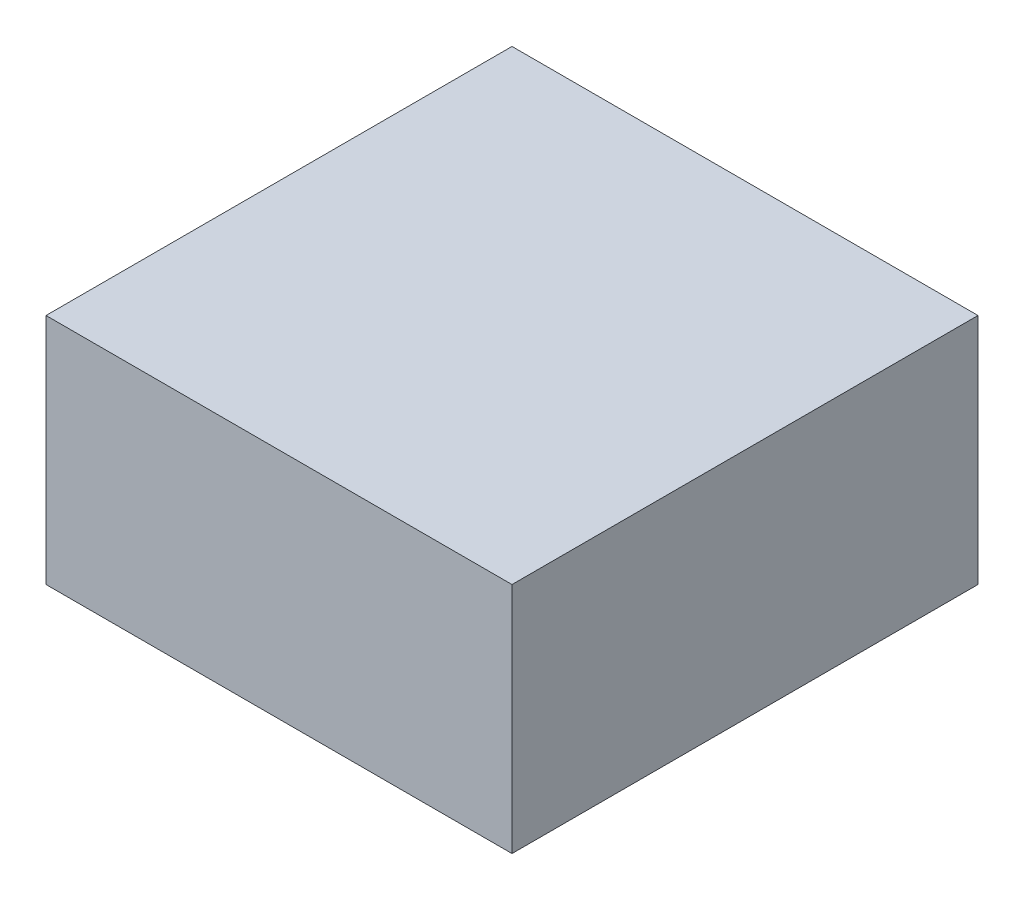
ISO-10303-21;
HEADER;
FILE_DESCRIPTION(('STEP AP214'),'2;1');
FILE_NAME('part.step','',(''),(''),'','','');
FILE_SCHEMA(('AUTOMOTIVE_DESIGN { 1 0 10303 214 1 1 1 1 }'));
ENDSEC;
DATA;
#1=APPLICATION_CONTEXT('core data for automotive mechanical design processes');
#2=APPLICATION_PROTOCOL_DEFINITION('international standard','automotive_design',2000,#1);
#3=PRODUCT_CONTEXT('',#1,'mechanical');
#4=PRODUCT('Part','Part','',(#3));
#5=PRODUCT_RELATED_PRODUCT_CATEGORY('part','',(#4));
#6=PRODUCT_DEFINITION_FORMATION('','',#4);
#7=PRODUCT_DEFINITION_CONTEXT('part definition',#1,'design');
#8=PRODUCT_DEFINITION('design','',#6,#7);
#9=PRODUCT_DEFINITION_SHAPE('','',#8);
#10=(LENGTH_UNIT() NAMED_UNIT(*) SI_UNIT(.MILLI.,.METRE.));
#11=(NAMED_UNIT(*) PLANE_ANGLE_UNIT() SI_UNIT($,.RADIAN.));
#12=(NAMED_UNIT(*) SI_UNIT($,.STERADIAN.) SOLID_ANGLE_UNIT());
#13=UNCERTAINTY_MEASURE_WITH_UNIT(LENGTH_MEASURE(1.E-05),#10,'distance_accuracy_value','');
#14=(GEOMETRIC_REPRESENTATION_CONTEXT(3) GLOBAL_UNCERTAINTY_ASSIGNED_CONTEXT((#13)) GLOBAL_UNIT_ASSIGNED_CONTEXT((#10,
#11,#12)) REPRESENTATION_CONTEXT('',''));
#15=CARTESIAN_POINT('',(0.,0.,0.));
#16=DIRECTION('',(0.,0.,1.));
#17=DIRECTION('',(1.,0.,0.));
#18=AXIS2_PLACEMENT_3D('',#15,#16,#17);
#19=CARTESIAN_POINT('',(-50.,-25.,100.));
#20=DIRECTION('',(1.,0.,0.));
#21=DIRECTION('',(0.,0.,-1.));
#22=AXIS2_PLACEMENT_3D('',#19,#20,#21);
#23=PLANE('',#22);
#24=DIRECTION('',(0.,-1.,0.));
#25=VECTOR('',#24,1.);
#26=CARTESIAN_POINT('',(-50.,-25.,0.));
#27=LINE('',#26,#25);
#28=CARTESIAN_POINT('',(-50.,25.,0.));
#29=VERTEX_POINT('',#28);
#30=CARTESIAN_POINT('',(-50.,-25.,0.));
#31=VERTEX_POINT('',#30);
#32=EDGE_CURVE('E113',#29,#31,#27,.T.);
#33=ORIENTED_EDGE('',*,*,#32,.T.);
#34=DIRECTION('',(0.,0.,-1.));
#35=VECTOR('',#34,1.);
#36=CARTESIAN_POINT('',(-50.,-25.,100.));
#37=LINE('',#36,#35);
#38=CARTESIAN_POINT('',(-50.,-25.,100.));
#39=VERTEX_POINT('',#38);
#40=EDGE_CURVE('E11',#39,#31,#37,.T.);
#41=ORIENTED_EDGE('',*,*,#40,.F.);
#42=DIRECTION('',(0.,-1.,0.));
#43=VECTOR('',#42,1.);
#44=CARTESIAN_POINT('',(-50.,-25.,100.));
#45=LINE('',#44,#43);
#46=CARTESIAN_POINT('',(-50.,25.,100.));
#47=VERTEX_POINT('',#46);
#48=EDGE_CURVE('E97',#47,#39,#45,.T.);
#49=ORIENTED_EDGE('',*,*,#48,.F.);
#50=DIRECTION('',(0.,0.,-1.));
#51=VECTOR('',#50,1.);
#52=CARTESIAN_POINT('',(-50.,25.,100.));
#53=LINE('',#52,#51);
#54=EDGE_CURVE('E109',#47,#29,#53,.T.);
#55=ORIENTED_EDGE('',*,*,#54,.T.);
#56=EDGE_LOOP('',(#33,#41,#49,#55));
#57=FACE_BOUND('',#56,.T.);
#58=ADVANCED_FACE('F45',(#57),#23,.F.);
#59=CARTESIAN_POINT('',(50.,-25.,100.));
#60=DIRECTION('',(0.,1.,0.));
#61=DIRECTION('',(-1.,0.,0.));
#62=AXIS2_PLACEMENT_3D('',#59,#60,#61);
#63=PLANE('',#62);
#64=DIRECTION('',(1.,0.,0.));
#65=VECTOR('',#64,1.);
#66=CARTESIAN_POINT('',(50.,-25.,0.));
#67=LINE('',#66,#65);
#68=CARTESIAN_POINT('',(50.,-25.,0.));
#69=VERTEX_POINT('',#68);
#70=EDGE_CURVE('E102',#31,#69,#67,.T.);
#71=ORIENTED_EDGE('',*,*,#70,.T.);
#72=DIRECTION('',(0.,0.,-1.));
#73=VECTOR('',#72,1.);
#74=CARTESIAN_POINT('',(50.,-25.,100.));
#75=LINE('',#74,#73);
#76=CARTESIAN_POINT('',(50.,-25.,100.));
#77=VERTEX_POINT('',#76);
#78=EDGE_CURVE('E54',#77,#69,#75,.T.);
#79=ORIENTED_EDGE('',*,*,#78,.F.);
#80=DIRECTION('',(1.,0.,0.));
#81=VECTOR('',#80,1.);
#82=CARTESIAN_POINT('',(50.,-25.,100.));
#83=LINE('',#82,#81);
#84=EDGE_CURVE('E92',#39,#77,#83,.T.);
#85=ORIENTED_EDGE('',*,*,#84,.F.);
#86=ORIENTED_EDGE('',*,*,#40,.T.);
#87=EDGE_LOOP('',(#71,#79,#85,#86));
#88=FACE_BOUND('',#87,.T.);
#89=ADVANCED_FACE('F101',(#88),#63,.F.);
#90=CARTESIAN_POINT('',(50.,-25.,100.));
#91=DIRECTION('',(-1.,0.,0.));
#92=DIRECTION('',(0.,0.,1.));
#93=AXIS2_PLACEMENT_3D('',#90,#91,#92);
#94=PLANE('',#93);
#95=DIRECTION('',(0.,1.,0.));
#96=VECTOR('',#95,1.);
#97=CARTESIAN_POINT('',(50.,-25.,0.));
#98=LINE('',#97,#96);
#99=CARTESIAN_POINT('',(50.,25.,0.));
#100=VERTEX_POINT('',#99);
#101=EDGE_CURVE('E79',#69,#100,#98,.T.);
#102=ORIENTED_EDGE('',*,*,#101,.T.);
#103=DIRECTION('',(0.,0.,-1.));
#104=VECTOR('',#103,1.);
#105=CARTESIAN_POINT('',(50.,25.,100.));
#106=LINE('',#105,#104);
#107=CARTESIAN_POINT('',(50.,25.,100.));
#108=VERTEX_POINT('',#107);
#109=EDGE_CURVE('E104',#108,#100,#106,.T.);
#110=ORIENTED_EDGE('',*,*,#109,.F.);
#111=DIRECTION('',(0.,1.,0.));
#112=VECTOR('',#111,1.);
#113=CARTESIAN_POINT('',(50.,-25.,100.));
#114=LINE('',#113,#112);
#115=EDGE_CURVE('E95',#77,#108,#114,.T.);
#116=ORIENTED_EDGE('',*,*,#115,.F.);
#117=ORIENTED_EDGE('',*,*,#78,.T.);
#118=EDGE_LOOP('',(#102,#110,#116,#117));
#119=FACE_BOUND('',#118,.T.);
#120=ADVANCED_FACE('F105',(#119),#94,.F.);
#121=CARTESIAN_POINT('',(50.,25.,100.));
#122=DIRECTION('',(0.,-1.,0.));
#123=DIRECTION('',(1.,0.,0.));
#124=AXIS2_PLACEMENT_3D('',#121,#122,#123);
#125=PLANE('',#124);
#126=DIRECTION('',(-1.,0.,0.));
#127=VECTOR('',#126,1.);
#128=CARTESIAN_POINT('',(50.,25.,0.));
#129=LINE('',#128,#127);
#130=EDGE_CURVE('E85',#100,#29,#129,.T.);
#131=ORIENTED_EDGE('',*,*,#130,.T.);
#132=ORIENTED_EDGE('',*,*,#54,.F.);
#133=DIRECTION('',(-1.,0.,0.));
#134=VECTOR('',#133,1.);
#135=CARTESIAN_POINT('',(50.,25.,100.));
#136=LINE('',#135,#134);
#137=EDGE_CURVE('E62',#108,#47,#136,.T.);
#138=ORIENTED_EDGE('',*,*,#137,.F.);
#139=ORIENTED_EDGE('',*,*,#109,.T.);
#140=EDGE_LOOP('',(#131,#132,#138,#139));
#141=FACE_BOUND('',#140,.T.);
#142=ADVANCED_FACE('F126',(#141),#125,.F.);
#143=CARTESIAN_POINT('',(0.,0.,100.));
#144=DIRECTION('',(0.,0.,1.));
#145=DIRECTION('',(1.,0.,0.));
#146=AXIS2_PLACEMENT_3D('',#143,#144,#145);
#147=PLANE('',#146);
#148=ORIENTED_EDGE('',*,*,#48,.T.);
#149=ORIENTED_EDGE('',*,*,#84,.T.);
#150=ORIENTED_EDGE('',*,*,#115,.T.);
#151=ORIENTED_EDGE('',*,*,#137,.T.);
#152=EDGE_LOOP('',(#148,#149,#150,#151));
#153=FACE_BOUND('',#152,.T.);
#154=ADVANCED_FACE('F93',(#153),#147,.T.);
#155=CARTESIAN_POINT('',(0.,0.,0.));
#156=DIRECTION('',(0.,0.,1.));
#157=DIRECTION('',(1.,0.,0.));
#158=AXIS2_PLACEMENT_3D('',#155,#156,#157);
#159=PLANE('',#158);
#160=ORIENTED_EDGE('',*,*,#32,.F.);
#161=ORIENTED_EDGE('',*,*,#130,.F.);
#162=ORIENTED_EDGE('',*,*,#101,.F.);
#163=ORIENTED_EDGE('',*,*,#70,.F.);
#164=EDGE_LOOP('',(#160,#161,#162,#163));
#165=FACE_BOUND('',#164,.T.);
#166=ADVANCED_FACE('F129',(#165),#159,.F.);
#167=CLOSED_SHELL('',(#58,#89,#120,#142,#154,#166));
#168=MANIFOLD_SOLID_BREP('B2',#167);
#169=ADVANCED_BREP_SHAPE_REPRESENTATION('',(#18,#168),#14);
#170=SHAPE_DEFINITION_REPRESENTATION(#9,#169);
ENDSEC;
END-ISO-10303-21;
